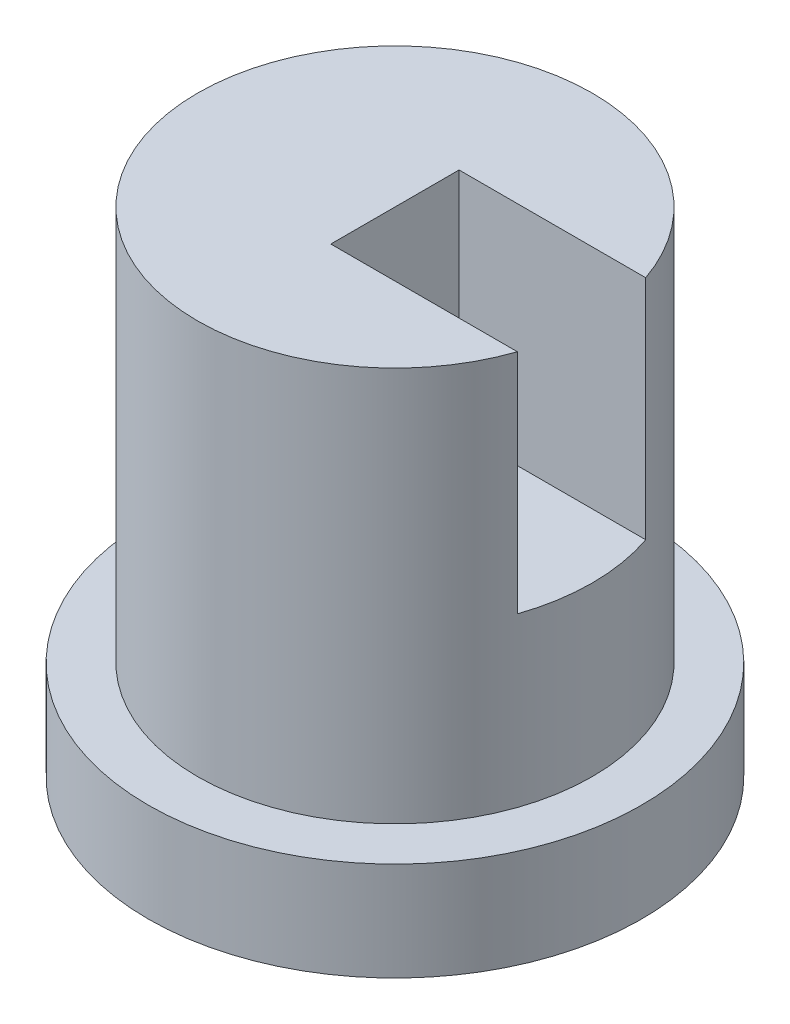
ISO-10303-21;
HEADER;
FILE_DESCRIPTION(('STEP AP214'),'2;1');
FILE_NAME('part.step','',(''),(''),'','','');
FILE_SCHEMA(('AUTOMOTIVE_DESIGN { 1 0 10303 214 1 1 1 1 }'));
ENDSEC;
DATA;
#1=APPLICATION_CONTEXT('core data for automotive mechanical design processes');
#2=APPLICATION_PROTOCOL_DEFINITION('international standard','automotive_design',2000,#1);
#3=PRODUCT_CONTEXT('',#1,'mechanical');
#4=PRODUCT('Part','Part','',(#3));
#5=PRODUCT_RELATED_PRODUCT_CATEGORY('part','',(#4));
#6=PRODUCT_DEFINITION_FORMATION('','',#4);
#7=PRODUCT_DEFINITION_CONTEXT('part definition',#1,'design');
#8=PRODUCT_DEFINITION('design','',#6,#7);
#9=PRODUCT_DEFINITION_SHAPE('','',#8);
#10=(LENGTH_UNIT() NAMED_UNIT(*) SI_UNIT(.MILLI.,.METRE.));
#11=(NAMED_UNIT(*) PLANE_ANGLE_UNIT() SI_UNIT($,.RADIAN.));
#12=(NAMED_UNIT(*) SI_UNIT($,.STERADIAN.) SOLID_ANGLE_UNIT());
#13=UNCERTAINTY_MEASURE_WITH_UNIT(LENGTH_MEASURE(1.E-05),#10,'distance_accuracy_value','');
#14=(GEOMETRIC_REPRESENTATION_CONTEXT(3) GLOBAL_UNCERTAINTY_ASSIGNED_CONTEXT((#13)) GLOBAL_UNIT_ASSIGNED_CONTEXT((#10,
#11,#12)) REPRESENTATION_CONTEXT('',''));
#15=CARTESIAN_POINT('',(0.,0.,0.));
#16=DIRECTION('',(0.,0.,1.));
#17=DIRECTION('',(1.,0.,0.));
#18=AXIS2_PLACEMENT_3D('',#15,#16,#17);
#19=CARTESIAN_POINT('',(0.,50.,0.));
#20=DIRECTION('',(0.,-1.,0.));
#21=DIRECTION('',(0.,0.,-1.));
#22=AXIS2_PLACEMENT_3D('',#19,#20,#21);
#23=CYLINDRICAL_SURFACE('',#22,20.);
#24=CARTESIAN_POINT('',(0.,10.,0.));
#25=DIRECTION('',(0.,1.,0.));
#26=DIRECTION('',(0.,0.,1.));
#27=AXIS2_PLACEMENT_3D('',#24,#25,#26);
#28=CIRCLE('',#27,20.);
#29=CARTESIAN_POINT('',(0.,10.,20.));
#30=VERTEX_POINT('',#29);
#31=EDGE_CURVE('E117',#30,#30,#28,.T.);
#32=ORIENTED_EDGE('',*,*,#31,.T.);
#33=EDGE_LOOP('',(#32));
#34=FACE_BOUND('',#33,.T.);
#35=DIRECTION('',(0.,-1.,0.));
#36=VECTOR('',#35,1.);
#37=CARTESIAN_POINT('',(18.9142803193777,50.,6.5));
#38=LINE('',#37,#36);
#39=CARTESIAN_POINT('',(18.9142803193777,50.,6.5));
#40=VERTEX_POINT('',#39);
#41=CARTESIAN_POINT('',(18.9142803193777,27.,6.5));
#42=VERTEX_POINT('',#41);
#43=EDGE_CURVE('E84',#40,#42,#38,.T.);
#44=ORIENTED_EDGE('',*,*,#43,.F.);
#45=CARTESIAN_POINT('',(0.,50.,0.));
#46=DIRECTION('',(0.,1.,0.));
#47=DIRECTION('',(0.,0.,1.));
#48=AXIS2_PLACEMENT_3D('',#45,#46,#47);
#49=CIRCLE('',#48,20.);
#50=CARTESIAN_POINT('',(18.9142803193777,50.,-6.5));
#51=VERTEX_POINT('',#50);
#52=EDGE_CURVE('E112',#51,#40,#49,.T.);
#53=ORIENTED_EDGE('',*,*,#52,.F.);
#54=DIRECTION('',(0.,-1.,0.));
#55=VECTOR('',#54,1.);
#56=CARTESIAN_POINT('',(18.9142803193777,50.,-6.5));
#57=LINE('',#56,#55);
#58=CARTESIAN_POINT('',(18.9142803193777,27.,-6.5));
#59=VERTEX_POINT('',#58);
#60=EDGE_CURVE('E88',#59,#51,#57,.F.);
#61=ORIENTED_EDGE('',*,*,#60,.F.);
#62=CARTESIAN_POINT('',(0.,27.,0.));
#63=DIRECTION('',(0.,1.,0.));
#64=DIRECTION('',(0.,0.,1.));
#65=AXIS2_PLACEMENT_3D('',#62,#63,#64);
#66=CIRCLE('',#65,20.);
#67=EDGE_CURVE('E11',#42,#59,#66,.T.);
#68=ORIENTED_EDGE('',*,*,#67,.F.);
#69=EDGE_LOOP('',(#44,#53,#61,#68));
#70=FACE_BOUND('',#69,.T.);
#71=ADVANCED_FACE('F39',(#34,#70),#23,.T.);
#72=CARTESIAN_POINT('',(0.,50.,0.));
#73=DIRECTION('',(0.,1.,0.));
#74=DIRECTION('',(0.,0.,1.));
#75=AXIS2_PLACEMENT_3D('',#72,#73,#74);
#76=PLANE('',#75);
#77=ORIENTED_EDGE('',*,*,#52,.T.);
#78=DIRECTION('',(-1.,0.,0.));
#79=VECTOR('',#78,1.);
#80=CARTESIAN_POINT('',(0.,50.,6.5));
#81=LINE('',#80,#79);
#82=CARTESIAN_POINT('',(0.,50.,6.5));
#83=VERTEX_POINT('',#82);
#84=EDGE_CURVE('E48',#40,#83,#81,.T.);
#85=ORIENTED_EDGE('',*,*,#84,.T.);
#86=DIRECTION('',(0.,0.,1.));
#87=VECTOR('',#86,1.);
#88=CARTESIAN_POINT('',(0.,50.,6.5));
#89=LINE('',#88,#87);
#90=CARTESIAN_POINT('',(0.,50.,-6.5));
#91=VERTEX_POINT('',#90);
#92=EDGE_CURVE('E98',#91,#83,#89,.T.);
#93=ORIENTED_EDGE('',*,*,#92,.F.);
#94=DIRECTION('',(1.,0.,0.));
#95=VECTOR('',#94,1.);
#96=CARTESIAN_POINT('',(0.,50.,-6.5));
#97=LINE('',#96,#95);
#98=EDGE_CURVE('E121',#91,#51,#97,.T.);
#99=ORIENTED_EDGE('',*,*,#98,.T.);
#100=EDGE_LOOP('',(#77,#85,#93,#99));
#101=FACE_BOUND('',#100,.T.);
#102=ADVANCED_FACE('F133',(#101),#76,.T.);
#103=CARTESIAN_POINT('',(0.,10.,0.));
#104=DIRECTION('',(0.,-1.,0.));
#105=DIRECTION('',(0.,0.,-1.));
#106=AXIS2_PLACEMENT_3D('',#103,#104,#105);
#107=CYLINDRICAL_SURFACE('',#106,25.);
#108=CARTESIAN_POINT('',(0.,10.,0.));
#109=DIRECTION('',(0.,1.,0.));
#110=DIRECTION('',(0.,0.,1.));
#111=AXIS2_PLACEMENT_3D('',#108,#109,#110);
#112=CIRCLE('',#111,25.);
#113=CARTESIAN_POINT('',(0.,10.,25.));
#114=VERTEX_POINT('',#113);
#115=EDGE_CURVE('E122',#114,#114,#112,.T.);
#116=ORIENTED_EDGE('',*,*,#115,.F.);
#117=EDGE_LOOP('',(#116));
#118=FACE_BOUND('',#117,.T.);
#119=CARTESIAN_POINT('',(0.,0.,0.));
#120=DIRECTION('',(0.,1.,0.));
#121=DIRECTION('',(0.,0.,1.));
#122=AXIS2_PLACEMENT_3D('',#119,#120,#121);
#123=CIRCLE('',#122,25.);
#124=CARTESIAN_POINT('',(0.,0.,25.));
#125=VERTEX_POINT('',#124);
#126=EDGE_CURVE('E116',#125,#125,#123,.T.);
#127=ORIENTED_EDGE('',*,*,#126,.T.);
#128=EDGE_LOOP('',(#127));
#129=FACE_BOUND('',#128,.T.);
#130=ADVANCED_FACE('F41',(#118,#129),#107,.T.);
#131=CARTESIAN_POINT('',(0.,10.,0.));
#132=DIRECTION('',(0.,1.,0.));
#133=DIRECTION('',(0.,0.,1.));
#134=AXIS2_PLACEMENT_3D('',#131,#132,#133);
#135=PLANE('',#134);
#136=ORIENTED_EDGE('',*,*,#31,.F.);
#137=EDGE_LOOP('',(#136));
#138=FACE_BOUND('',#137,.T.);
#139=ORIENTED_EDGE('',*,*,#115,.T.);
#140=EDGE_LOOP('',(#139));
#141=FACE_BOUND('',#140,.T.);
#142=ADVANCED_FACE('F156',(#138,#141),#135,.T.);
#143=CARTESIAN_POINT('',(0.,0.,0.));
#144=DIRECTION('',(0.,1.,0.));
#145=DIRECTION('',(0.,0.,1.));
#146=AXIS2_PLACEMENT_3D('',#143,#144,#145);
#147=PLANE('',#146);
#148=ORIENTED_EDGE('',*,*,#126,.F.);
#149=EDGE_LOOP('',(#148));
#150=FACE_BOUND('',#149,.T.);
#151=ADVANCED_FACE('F158',(#150),#147,.F.);
#152=CARTESIAN_POINT('',(40.,27.,6.5));
#153=DIRECTION('',(0.,1.,0.));
#154=DIRECTION('',(0.,0.,1.));
#155=AXIS2_PLACEMENT_3D('',#152,#153,#154);
#156=PLANE('',#155);
#157=ORIENTED_EDGE('',*,*,#67,.T.);
#158=DIRECTION('',(-1.,0.,0.));
#159=VECTOR('',#158,1.);
#160=CARTESIAN_POINT('',(40.,27.,-6.5));
#161=LINE('',#160,#159);
#162=CARTESIAN_POINT('',(0.,27.,-6.5));
#163=VERTEX_POINT('',#162);
#164=EDGE_CURVE('E89',#59,#163,#161,.T.);
#165=ORIENTED_EDGE('',*,*,#164,.T.);
#166=DIRECTION('',(0.,0.,-1.));
#167=VECTOR('',#166,1.);
#168=CARTESIAN_POINT('',(0.,27.,6.5));
#169=LINE('',#168,#167);
#170=CARTESIAN_POINT('',(0.,27.,6.5));
#171=VERTEX_POINT('',#170);
#172=EDGE_CURVE('E91',#171,#163,#169,.T.);
#173=ORIENTED_EDGE('',*,*,#172,.F.);
#174=DIRECTION('',(-1.,0.,0.));
#175=VECTOR('',#174,1.);
#176=CARTESIAN_POINT('',(40.,27.,6.5));
#177=LINE('',#176,#175);
#178=EDGE_CURVE('E79',#42,#171,#177,.T.);
#179=ORIENTED_EDGE('',*,*,#178,.F.);
#180=EDGE_LOOP('',(#157,#165,#173,#179));
#181=FACE_BOUND('',#180,.T.);
#182=ADVANCED_FACE('F92',(#181),#156,.T.);
#183=CARTESIAN_POINT('',(40.,50.,6.5));
#184=DIRECTION('',(0.,0.,-1.));
#185=DIRECTION('',(-1.,0.,0.));
#186=AXIS2_PLACEMENT_3D('',#183,#184,#185);
#187=PLANE('',#186);
#188=ORIENTED_EDGE('',*,*,#43,.T.);
#189=ORIENTED_EDGE('',*,*,#178,.T.);
#190=DIRECTION('',(0.,-1.,0.));
#191=VECTOR('',#190,1.);
#192=CARTESIAN_POINT('',(0.,50.,6.5));
#193=LINE('',#192,#191);
#194=EDGE_CURVE('E83',#83,#171,#193,.T.);
#195=ORIENTED_EDGE('',*,*,#194,.F.);
#196=ORIENTED_EDGE('',*,*,#84,.F.);
#197=EDGE_LOOP('',(#188,#189,#195,#196));
#198=FACE_BOUND('',#197,.T.);
#199=ADVANCED_FACE('F81',(#198),#187,.T.);
#200=CARTESIAN_POINT('',(40.,50.,-6.5));
#201=DIRECTION('',(0.,0.,1.));
#202=DIRECTION('',(0.,-1.,0.));
#203=AXIS2_PLACEMENT_3D('',#200,#201,#202);
#204=PLANE('',#203);
#205=ORIENTED_EDGE('',*,*,#60,.T.);
#206=ORIENTED_EDGE('',*,*,#98,.F.);
#207=DIRECTION('',(0.,1.,0.));
#208=VECTOR('',#207,1.);
#209=CARTESIAN_POINT('',(0.,50.,-6.5));
#210=LINE('',#209,#208);
#211=EDGE_CURVE('E55',#163,#91,#210,.T.);
#212=ORIENTED_EDGE('',*,*,#211,.F.);
#213=ORIENTED_EDGE('',*,*,#164,.F.);
#214=EDGE_LOOP('',(#205,#206,#212,#213));
#215=FACE_BOUND('',#214,.T.);
#216=ADVANCED_FACE('F138',(#215),#204,.T.);
#217=CARTESIAN_POINT('',(0.,0.,0.));
#218=DIRECTION('',(1.,0.,0.));
#219=DIRECTION('',(0.,0.,-1.));
#220=AXIS2_PLACEMENT_3D('',#217,#218,#219);
#221=PLANE('',#220);
#222=ORIENTED_EDGE('',*,*,#194,.T.);
#223=ORIENTED_EDGE('',*,*,#172,.T.);
#224=ORIENTED_EDGE('',*,*,#211,.T.);
#225=ORIENTED_EDGE('',*,*,#92,.T.);
#226=EDGE_LOOP('',(#222,#223,#224,#225));
#227=FACE_BOUND('',#226,.T.);
#228=ADVANCED_FACE('F96',(#227),#221,.T.);
#229=CLOSED_SHELL('',(#71,#102,#130,#142,#151,#182,#199,#216,#228));
#230=MANIFOLD_SOLID_BREP('B2',#229);
#231=ADVANCED_BREP_SHAPE_REPRESENTATION('',(#18,#230),#14);
#232=SHAPE_DEFINITION_REPRESENTATION(#9,#231);
ENDSEC;
END-ISO-10303-21;
